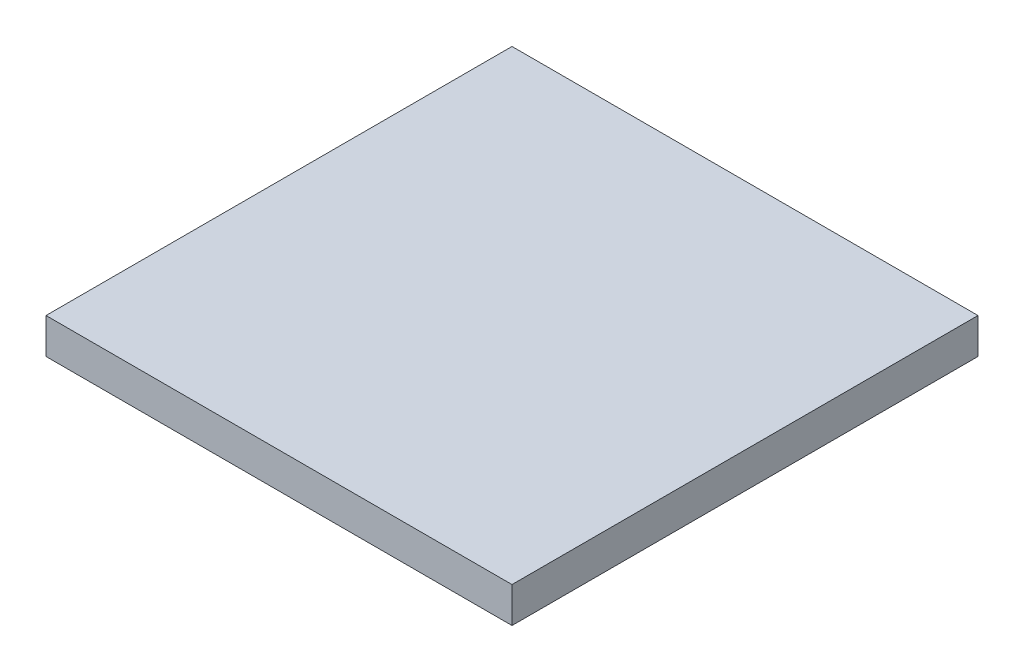
ISO-10303-21;
HEADER;
FILE_DESCRIPTION(('STEP AP214'),'2;1');
FILE_NAME('part.step','',(''),(''),'','','');
FILE_SCHEMA(('AUTOMOTIVE_DESIGN { 1 0 10303 214 1 1 1 1 }'));
ENDSEC;
DATA;
#1=APPLICATION_CONTEXT('core data for automotive mechanical design processes');
#2=APPLICATION_PROTOCOL_DEFINITION('international standard','automotive_design',2000,#1);
#3=PRODUCT_CONTEXT('',#1,'mechanical');
#4=PRODUCT('Part','Part','',(#3));
#5=PRODUCT_RELATED_PRODUCT_CATEGORY('part','',(#4));
#6=PRODUCT_DEFINITION_FORMATION('','',#4);
#7=PRODUCT_DEFINITION_CONTEXT('part definition',#1,'design');
#8=PRODUCT_DEFINITION('design','',#6,#7);
#9=PRODUCT_DEFINITION_SHAPE('','',#8);
#10=(LENGTH_UNIT() NAMED_UNIT(*) SI_UNIT(.MILLI.,.METRE.));
#11=(NAMED_UNIT(*) PLANE_ANGLE_UNIT() SI_UNIT($,.RADIAN.));
#12=(NAMED_UNIT(*) SI_UNIT($,.STERADIAN.) SOLID_ANGLE_UNIT());
#13=UNCERTAINTY_MEASURE_WITH_UNIT(LENGTH_MEASURE(1.E-05),#10,'distance_accuracy_value','');
#14=(GEOMETRIC_REPRESENTATION_CONTEXT(3) GLOBAL_UNCERTAINTY_ASSIGNED_CONTEXT((#13)) GLOBAL_UNIT_ASSIGNED_CONTEXT((#10,
#11,#12)) REPRESENTATION_CONTEXT('',''));
#15=CARTESIAN_POINT('',(0.,0.,0.));
#16=DIRECTION('',(0.,0.,1.));
#17=DIRECTION('',(1.,0.,0.));
#18=AXIS2_PLACEMENT_3D('',#15,#16,#17);
#19=CARTESIAN_POINT('',(0.,0.381,0.));
#20=DIRECTION('',(1.,0.,0.));
#21=DIRECTION('',(0.,0.,-1.));
#22=AXIS2_PLACEMENT_3D('',#19,#20,#21);
#23=PLANE('',#22);
#24=DIRECTION('',(0.,0.,1.));
#25=VECTOR('',#24,1.);
#26=CARTESIAN_POINT('',(0.,0.,0.));
#27=LINE('',#26,#25);
#28=CARTESIAN_POINT('',(0.,0.,-5.));
#29=VERTEX_POINT('',#28);
#30=CARTESIAN_POINT('',(0.,0.,0.));
#31=VERTEX_POINT('',#30);
#32=EDGE_CURVE('E101',#29,#31,#27,.T.);
#33=ORIENTED_EDGE('',*,*,#32,.T.);
#34=DIRECTION('',(0.,-1.,0.));
#35=VECTOR('',#34,1.);
#36=CARTESIAN_POINT('',(0.,0.381,0.));
#37=LINE('',#36,#35);
#38=CARTESIAN_POINT('',(0.,0.381,0.));
#39=VERTEX_POINT('',#38);
#40=EDGE_CURVE('E11',#39,#31,#37,.T.);
#41=ORIENTED_EDGE('',*,*,#40,.F.);
#42=DIRECTION('',(0.,0.,1.));
#43=VECTOR('',#42,1.);
#44=CARTESIAN_POINT('',(0.,0.381,0.));
#45=LINE('',#44,#43);
#46=CARTESIAN_POINT('',(0.,0.381,-5.));
#47=VERTEX_POINT('',#46);
#48=EDGE_CURVE('E89',#47,#39,#45,.T.);
#49=ORIENTED_EDGE('',*,*,#48,.F.);
#50=DIRECTION('',(0.,-1.,0.));
#51=VECTOR('',#50,1.);
#52=CARTESIAN_POINT('',(0.,0.381,-5.));
#53=LINE('',#52,#51);
#54=EDGE_CURVE('E97',#47,#29,#53,.T.);
#55=ORIENTED_EDGE('',*,*,#54,.T.);
#56=EDGE_LOOP('',(#33,#41,#49,#55));
#57=FACE_BOUND('',#56,.T.);
#58=ADVANCED_FACE('F38',(#57),#23,.F.);
#59=CARTESIAN_POINT('',(0.,0.381,0.));
#60=DIRECTION('',(0.,0.,-1.));
#61=DIRECTION('',(-1.,0.,0.));
#62=AXIS2_PLACEMENT_3D('',#59,#60,#61);
#63=PLANE('',#62);
#64=DIRECTION('',(1.,0.,0.));
#65=VECTOR('',#64,1.);
#66=CARTESIAN_POINT('',(0.,0.,0.));
#67=LINE('',#66,#65);
#68=CARTESIAN_POINT('',(5.,0.,0.));
#69=VERTEX_POINT('',#68);
#70=EDGE_CURVE('E93',#31,#69,#67,.T.);
#71=ORIENTED_EDGE('',*,*,#70,.T.);
#72=DIRECTION('',(0.,-1.,0.));
#73=VECTOR('',#72,1.);
#74=CARTESIAN_POINT('',(5.,0.381,0.));
#75=LINE('',#74,#73);
#76=CARTESIAN_POINT('',(5.,0.381,0.));
#77=VERTEX_POINT('',#76);
#78=EDGE_CURVE('E46',#77,#69,#75,.T.);
#79=ORIENTED_EDGE('',*,*,#78,.F.);
#80=DIRECTION('',(1.,0.,0.));
#81=VECTOR('',#80,1.);
#82=CARTESIAN_POINT('',(0.,0.381,0.));
#83=LINE('',#82,#81);
#84=EDGE_CURVE('E84',#39,#77,#83,.T.);
#85=ORIENTED_EDGE('',*,*,#84,.F.);
#86=ORIENTED_EDGE('',*,*,#40,.T.);
#87=EDGE_LOOP('',(#71,#79,#85,#86));
#88=FACE_BOUND('',#87,.T.);
#89=ADVANCED_FACE('F92',(#88),#63,.F.);
#90=CARTESIAN_POINT('',(5.,0.381,0.));
#91=DIRECTION('',(-1.,0.,0.));
#92=DIRECTION('',(0.,0.,1.));
#93=AXIS2_PLACEMENT_3D('',#90,#91,#92);
#94=PLANE('',#93);
#95=DIRECTION('',(0.,0.,-1.));
#96=VECTOR('',#95,1.);
#97=CARTESIAN_POINT('',(5.,0.,0.));
#98=LINE('',#97,#96);
#99=CARTESIAN_POINT('',(5.,0.,-5.));
#100=VERTEX_POINT('',#99);
#101=EDGE_CURVE('E71',#69,#100,#98,.T.);
#102=ORIENTED_EDGE('',*,*,#101,.T.);
#103=DIRECTION('',(0.,-1.,0.));
#104=VECTOR('',#103,1.);
#105=CARTESIAN_POINT('',(5.,0.381,-5.));
#106=LINE('',#105,#104);
#107=CARTESIAN_POINT('',(5.,0.381,-5.));
#108=VERTEX_POINT('',#107);
#109=EDGE_CURVE('E94',#108,#100,#106,.T.);
#110=ORIENTED_EDGE('',*,*,#109,.F.);
#111=DIRECTION('',(0.,0.,-1.));
#112=VECTOR('',#111,1.);
#113=CARTESIAN_POINT('',(5.,0.381,0.));
#114=LINE('',#113,#112);
#115=EDGE_CURVE('E87',#77,#108,#114,.T.);
#116=ORIENTED_EDGE('',*,*,#115,.F.);
#117=ORIENTED_EDGE('',*,*,#78,.T.);
#118=EDGE_LOOP('',(#102,#110,#116,#117));
#119=FACE_BOUND('',#118,.T.);
#120=ADVANCED_FACE('F95',(#119),#94,.F.);
#121=CARTESIAN_POINT('',(0.,0.381,-5.));
#122=DIRECTION('',(0.,0.,1.));
#123=DIRECTION('',(1.,0.,0.));
#124=AXIS2_PLACEMENT_3D('',#121,#122,#123);
#125=PLANE('',#124);
#126=DIRECTION('',(-1.,0.,0.));
#127=VECTOR('',#126,1.);
#128=CARTESIAN_POINT('',(0.,0.,-5.));
#129=LINE('',#128,#127);
#130=EDGE_CURVE('E77',#100,#29,#129,.T.);
#131=ORIENTED_EDGE('',*,*,#130,.T.);
#132=ORIENTED_EDGE('',*,*,#54,.F.);
#133=DIRECTION('',(-1.,0.,0.));
#134=VECTOR('',#133,1.);
#135=CARTESIAN_POINT('',(0.,0.381,-5.));
#136=LINE('',#135,#134);
#137=EDGE_CURVE('E54',#108,#47,#136,.T.);
#138=ORIENTED_EDGE('',*,*,#137,.F.);
#139=ORIENTED_EDGE('',*,*,#109,.T.);
#140=EDGE_LOOP('',(#131,#132,#138,#139));
#141=FACE_BOUND('',#140,.T.);
#142=ADVANCED_FACE('F108',(#141),#125,.F.);
#143=CARTESIAN_POINT('',(0.,0.381,0.));
#144=DIRECTION('',(0.,-1.,0.));
#145=DIRECTION('',(0.,0.,-1.));
#146=AXIS2_PLACEMENT_3D('',#143,#144,#145);
#147=PLANE('',#146);
#148=ORIENTED_EDGE('',*,*,#48,.T.);
#149=ORIENTED_EDGE('',*,*,#84,.T.);
#150=ORIENTED_EDGE('',*,*,#115,.T.);
#151=ORIENTED_EDGE('',*,*,#137,.T.);
#152=EDGE_LOOP('',(#148,#149,#150,#151));
#153=FACE_BOUND('',#152,.T.);
#154=ADVANCED_FACE('F85',(#153),#147,.F.);
#155=CARTESIAN_POINT('',(0.,0.,0.));
#156=DIRECTION('',(0.,-1.,0.));
#157=DIRECTION('',(0.,0.,-1.));
#158=AXIS2_PLACEMENT_3D('',#155,#156,#157);
#159=PLANE('',#158);
#160=ORIENTED_EDGE('',*,*,#32,.F.);
#161=ORIENTED_EDGE('',*,*,#130,.F.);
#162=ORIENTED_EDGE('',*,*,#101,.F.);
#163=ORIENTED_EDGE('',*,*,#70,.F.);
#164=EDGE_LOOP('',(#160,#161,#162,#163));
#165=FACE_BOUND('',#164,.T.);
#166=ADVANCED_FACE('F111',(#165),#159,.T.);
#167=CLOSED_SHELL('',(#58,#89,#120,#142,#154,#166));
#168=MANIFOLD_SOLID_BREP('B2',#167);
#169=ADVANCED_BREP_SHAPE_REPRESENTATION('',(#18,#168),#14);
#170=SHAPE_DEFINITION_REPRESENTATION(#9,#169);
ENDSEC;
END-ISO-10303-21;
